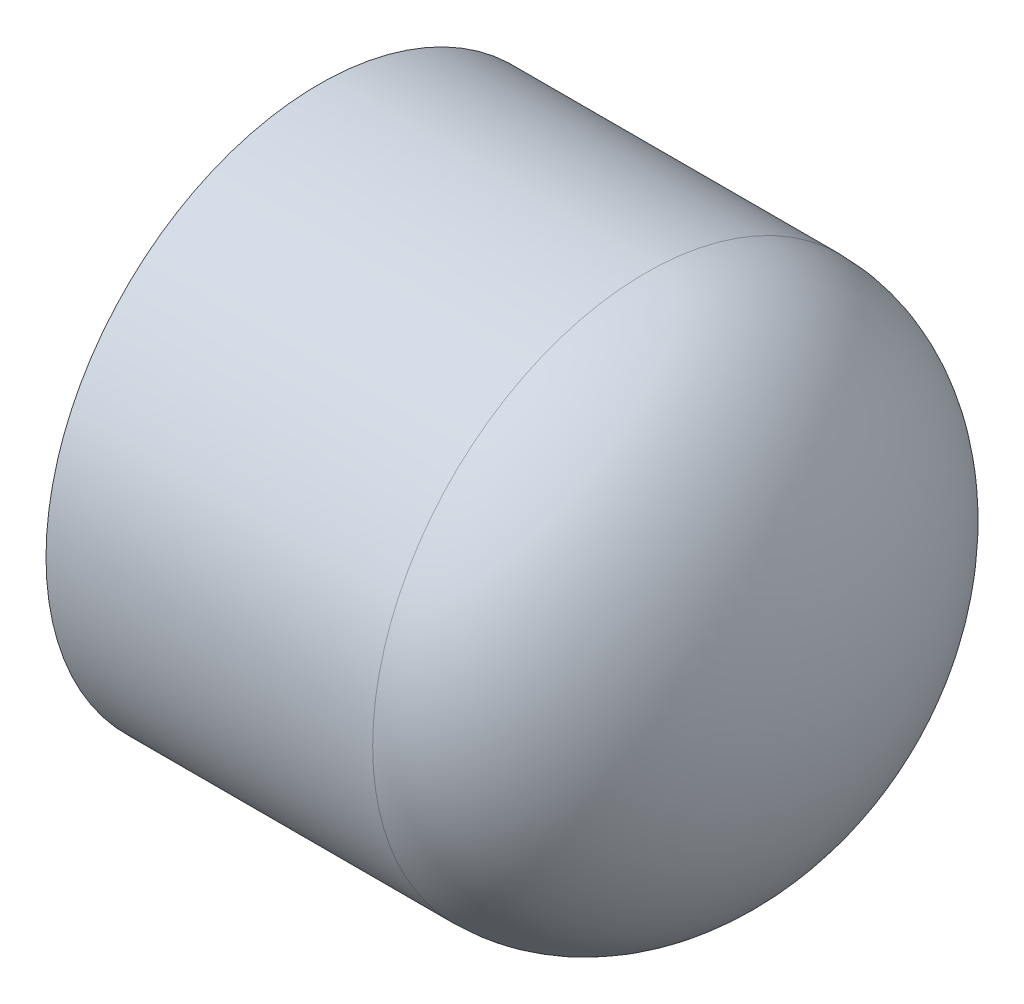
ISO-10303-21;
HEADER;
FILE_DESCRIPTION(('STEP AP214'),'2;1');
FILE_NAME('part.step','',(''),(''),'','','');
FILE_SCHEMA(('AUTOMOTIVE_DESIGN { 1 0 10303 214 1 1 1 1 }'));
ENDSEC;
DATA;
#1=APPLICATION_CONTEXT('core data for automotive mechanical design processes');
#2=APPLICATION_PROTOCOL_DEFINITION('international standard','automotive_design',2000,#1);
#3=PRODUCT_CONTEXT('',#1,'mechanical');
#4=PRODUCT('Part','Part','',(#3));
#5=PRODUCT_RELATED_PRODUCT_CATEGORY('part','',(#4));
#6=PRODUCT_DEFINITION_FORMATION('','',#4);
#7=PRODUCT_DEFINITION_CONTEXT('part definition',#1,'design');
#8=PRODUCT_DEFINITION('design','',#6,#7);
#9=PRODUCT_DEFINITION_SHAPE('','',#8);
#10=(LENGTH_UNIT() NAMED_UNIT(*) SI_UNIT(.MILLI.,.METRE.));
#11=(NAMED_UNIT(*) PLANE_ANGLE_UNIT() SI_UNIT($,.RADIAN.));
#12=(NAMED_UNIT(*) SI_UNIT($,.STERADIAN.) SOLID_ANGLE_UNIT());
#13=UNCERTAINTY_MEASURE_WITH_UNIT(LENGTH_MEASURE(1.E-05),#10,'distance_accuracy_value','');
#14=(GEOMETRIC_REPRESENTATION_CONTEXT(3) GLOBAL_UNCERTAINTY_ASSIGNED_CONTEXT((#13)) GLOBAL_UNIT_ASSIGNED_CONTEXT((#10,
#11,#12)) REPRESENTATION_CONTEXT('',''));
#15=CARTESIAN_POINT('',(0.,0.,0.));
#16=DIRECTION('',(0.,0.,1.));
#17=DIRECTION('',(1.,0.,0.));
#18=AXIS2_PLACEMENT_3D('',#15,#16,#17);
#19=CARTESIAN_POINT('',(-16.0401,0.,0.));
#20=DIRECTION('',(-1.,0.,0.));
#21=DIRECTION('',(0.,0.,1.));
#22=AXIS2_PLACEMENT_3D('',#19,#20,#21);
#23=CYLINDRICAL_SURFACE('',#22,16.9926);
#24=CARTESIAN_POINT('',(4.2799,0.,0.));
#25=DIRECTION('',(-1.,0.,0.));
#26=DIRECTION('',(0.,0.,1.));
#27=AXIS2_PLACEMENT_3D('',#24,#25,#26);
#28=CIRCLE('',#27,16.9926);
#29=CARTESIAN_POINT('',(4.2799,0.,16.9926));
#30=VERTEX_POINT('',#29);
#31=EDGE_CURVE('E11',#30,#30,#28,.T.);
#32=ORIENTED_EDGE('',*,*,#31,.T.);
#33=EDGE_LOOP('',(#32));
#34=FACE_BOUND('',#33,.T.);
#35=CARTESIAN_POINT('',(-16.0401,0.,0.));
#36=DIRECTION('',(-1.,0.,0.));
#37=DIRECTION('',(0.,0.,1.));
#38=AXIS2_PLACEMENT_3D('',#35,#36,#37);
#39=CIRCLE('',#38,16.9926);
#40=CARTESIAN_POINT('',(-16.0401,0.,16.9926));
#41=VERTEX_POINT('',#40);
#42=EDGE_CURVE('E55',#41,#41,#39,.T.);
#43=ORIENTED_EDGE('',*,*,#42,.F.);
#44=EDGE_LOOP('',(#43));
#45=FACE_BOUND('',#44,.T.);
#46=ADVANCED_FACE('F32',(#34,#45),#23,.T.);
#47=CARTESIAN_POINT('',(4.2799,0.,0.));
#48=DIRECTION('',(0.,0.,1.));
#49=DIRECTION('',(0.,1.,0.));
#50=AXIS2_PLACEMENT_3D('',#47,#48,#49);
#51=ELLIPSE('',#50,16.9926,11.7602);
#52=TRIMMED_CURVE('',#51,(PARAMETER_VALUE(1.5707963267949)),(PARAMETER_VALUE(4.71238898038469)),
.T.,.PARAMETER.);
#53=CARTESIAN_POINT('',(-16.0401,0.,0.));
#54=DIRECTION('',(-1.,0.,0.));
#55=AXIS1_PLACEMENT('',#53,#54);
#56=SURFACE_OF_REVOLUTION('',#52,#55);
#57=CARTESIAN_POINT('',(16.0401,0.,0.));
#58=VERTEX_POINT('',#57);
#59=VERTEX_LOOP('',#58);
#60=FACE_BOUND('',#59,.T.);
#61=ORIENTED_EDGE('',*,*,#31,.F.);
#62=EDGE_LOOP('',(#61));
#63=FACE_BOUND('',#62,.T.);
#64=ADVANCED_FACE('F45',(#60,#63),#56,.F.);
#65=CARTESIAN_POINT('',(4.2799,0.,0.));
#66=DIRECTION('',(0.,0.,-1.));
#67=DIRECTION('',(0.,-1.,0.));
#68=AXIS2_PLACEMENT_3D('',#65,#66,#67);
#69=ELLIPSE('',#68,13.2842,8.05179999999999);
#70=TRIMMED_CURVE('',#69,(PARAMETER_VALUE(4.71238898038469)),
(PARAMETER_VALUE(7.85398163397448)),.T.,.PARAMETER.);
#71=CARTESIAN_POINT('',(-16.0401,0.,0.));
#72=DIRECTION('',(-1.,0.,0.));
#73=AXIS1_PLACEMENT('',#71,#72);
#74=SURFACE_OF_REVOLUTION('',#70,#73);
#75=CARTESIAN_POINT('',(4.2799,0.,0.));
#76=DIRECTION('',(-1.,0.,0.));
#77=DIRECTION('',(0.,0.,1.));
#78=AXIS2_PLACEMENT_3D('',#75,#76,#77);
#79=CIRCLE('',#78,13.2842);
#80=CARTESIAN_POINT('',(4.2799,0.,13.2842));
#81=VERTEX_POINT('',#80);
#82=EDGE_CURVE('E39',#81,#81,#79,.T.);
#83=ORIENTED_EDGE('',*,*,#82,.T.);
#84=EDGE_LOOP('',(#83));
#85=FACE_BOUND('',#84,.T.);
#86=CARTESIAN_POINT('',(12.3317,0.,0.));
#87=VERTEX_POINT('',#86);
#88=VERTEX_LOOP('',#87);
#89=FACE_BOUND('',#88,.T.);
#90=ADVANCED_FACE('F48',(#85,#89),#74,.F.);
#91=CARTESIAN_POINT('',(4.2799,0.,0.));
#92=DIRECTION('',(-1.,0.,0.));
#93=DIRECTION('',(0.,0.,1.));
#94=AXIS2_PLACEMENT_3D('',#91,#92,#93);
#95=CONICAL_SURFACE('',#94,13.2842,0.00749985937974593);
#96=CARTESIAN_POINT('',(-16.0401,0.,0.));
#97=DIRECTION('',(-1.,0.,0.));
#98=DIRECTION('',(0.,0.,1.));
#99=AXIS2_PLACEMENT_3D('',#96,#97,#98);
#100=CIRCLE('',#99,13.4366);
#101=CARTESIAN_POINT('',(-16.0401,0.,13.4366));
#102=VERTEX_POINT('',#101);
#103=EDGE_CURVE('E57',#102,#102,#100,.T.);
#104=ORIENTED_EDGE('',*,*,#103,.T.);
#105=EDGE_LOOP('',(#104));
#106=FACE_BOUND('',#105,.T.);
#107=ORIENTED_EDGE('',*,*,#82,.F.);
#108=EDGE_LOOP('',(#107));
#109=FACE_BOUND('',#108,.T.);
#110=ADVANCED_FACE('F68',(#106,#109),#95,.F.);
#111=CARTESIAN_POINT('',(-16.0401,-16.9926,0.));
#112=DIRECTION('',(-1.,0.,0.));
#113=DIRECTION('',(0.,0.,1.));
#114=AXIS2_PLACEMENT_3D('',#111,#112,#113);
#115=PLANE('',#114);
#116=ORIENTED_EDGE('',*,*,#42,.T.);
#117=EDGE_LOOP('',(#116));
#118=FACE_BOUND('',#117,.T.);
#119=ORIENTED_EDGE('',*,*,#103,.F.);
#120=EDGE_LOOP('',(#119));
#121=FACE_BOUND('',#120,.T.);
#122=ADVANCED_FACE('F70',(#118,#121),#115,.T.);
#123=CLOSED_SHELL('',(#46,#64,#90,#110,#122));
#124=MANIFOLD_SOLID_BREP('B2',#123);
#125=ADVANCED_BREP_SHAPE_REPRESENTATION('',(#18,#124),#14);
#126=SHAPE_DEFINITION_REPRESENTATION(#9,#125);
ENDSEC;
END-ISO-10303-21;
